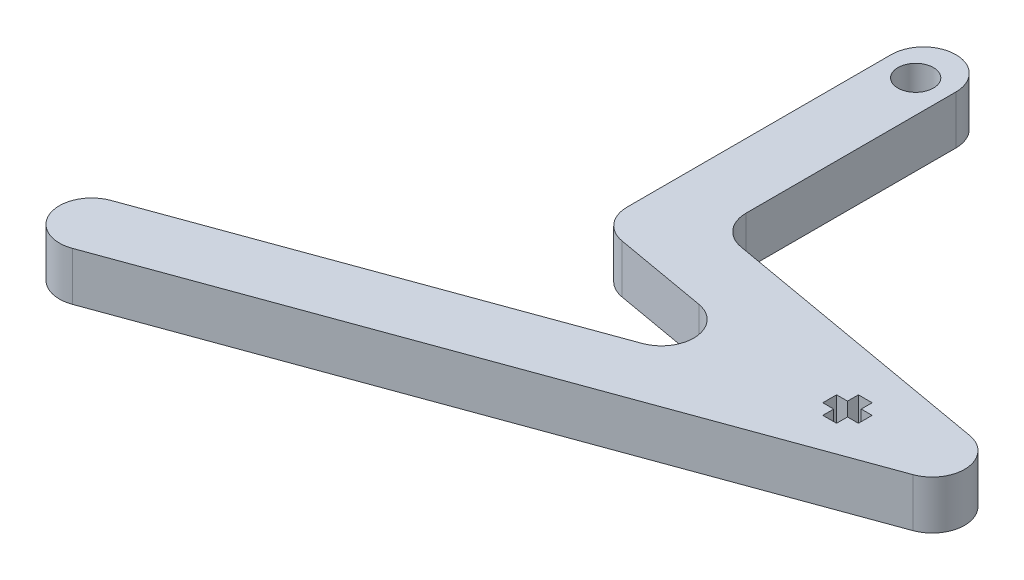
ISO-10303-21;
HEADER;
FILE_DESCRIPTION(('STEP AP214'),'2;1');
FILE_NAME('part.step','',(''),(''),'','','');
FILE_SCHEMA(('AUTOMOTIVE_DESIGN { 1 0 10303 214 1 1 1 1 }'));
ENDSEC;
DATA;
#1=APPLICATION_CONTEXT('core data for automotive mechanical design processes');
#2=APPLICATION_PROTOCOL_DEFINITION('international standard','automotive_design',2000,#1);
#3=PRODUCT_CONTEXT('',#1,'mechanical');
#4=PRODUCT('Part','Part','',(#3));
#5=PRODUCT_RELATED_PRODUCT_CATEGORY('part','',(#4));
#6=PRODUCT_DEFINITION_FORMATION('','',#4);
#7=PRODUCT_DEFINITION_CONTEXT('part definition',#1,'design');
#8=PRODUCT_DEFINITION('design','',#6,#7);
#9=PRODUCT_DEFINITION_SHAPE('','',#8);
#10=(LENGTH_UNIT() NAMED_UNIT(*) SI_UNIT(.MILLI.,.METRE.));
#11=(NAMED_UNIT(*) PLANE_ANGLE_UNIT() SI_UNIT($,.RADIAN.));
#12=(NAMED_UNIT(*) SI_UNIT($,.STERADIAN.) SOLID_ANGLE_UNIT());
#13=UNCERTAINTY_MEASURE_WITH_UNIT(LENGTH_MEASURE(1.E-05),#10,'distance_accuracy_value','');
#14=(GEOMETRIC_REPRESENTATION_CONTEXT(3) GLOBAL_UNCERTAINTY_ASSIGNED_CONTEXT((#13)) GLOBAL_UNIT_ASSIGNED_CONTEXT((#10,
#11,#12)) REPRESENTATION_CONTEXT('',''));
#15=CARTESIAN_POINT('',(0.,0.,0.));
#16=DIRECTION('',(0.,0.,1.));
#17=DIRECTION('',(1.,0.,0.));
#18=AXIS2_PLACEMENT_3D('',#15,#16,#17);
#19=CARTESIAN_POINT('',(0.,6.,0.));
#20=DIRECTION('',(0.,1.,0.));
#21=DIRECTION('',(0.,0.,1.));
#22=AXIS2_PLACEMENT_3D('',#19,#20,#21);
#23=PLANE('',#22);
#24=DIRECTION('',(0.,0.,1.));
#25=VECTOR('',#24,1.);
#26=CARTESIAN_POINT('',(-38.433012349143,6.,-5.2517052601802));
#27=LINE('',#26,#25);
#28=CARTESIAN_POINT('',(-38.433012349143,6.,-5.2517052601802));
#29=VERTEX_POINT('',#28);
#30=CARTESIAN_POINT('',(-38.433012349143,6.,-3.5517052601802));
#31=VERTEX_POINT('',#30);
#32=EDGE_CURVE('E228',#29,#31,#27,.T.);
#33=ORIENTED_EDGE('',*,*,#32,.F.);
#34=DIRECTION('',(-1.,0.,0.));
#35=VECTOR('',#34,1.);
#36=CARTESIAN_POINT('',(-37.083012349143,6.,-5.2517052601802));
#37=LINE('',#36,#35);
#38=CARTESIAN_POINT('',(-37.083012349143,6.,-5.2517052601802));
#39=VERTEX_POINT('',#38);
#40=EDGE_CURVE('E218',#39,#29,#37,.T.);
#41=ORIENTED_EDGE('',*,*,#40,.F.);
#42=DIRECTION('',(0.,0.,1.));
#43=VECTOR('',#42,1.);
#44=CARTESIAN_POINT('',(-37.083012349143,6.,-6.60170526018021));
#45=LINE('',#44,#43);
#46=CARTESIAN_POINT('',(-37.083012349143,6.,-6.60170526018021));
#47=VERTEX_POINT('',#46);
#48=EDGE_CURVE('E263',#47,#39,#45,.T.);
#49=ORIENTED_EDGE('',*,*,#48,.F.);
#50=DIRECTION('',(-1.,0.,0.));
#51=VECTOR('',#50,1.);
#52=CARTESIAN_POINT('',(-35.383012349143,6.,-6.60170526018021));
#53=LINE('',#52,#51);
#54=CARTESIAN_POINT('',(-35.383012349143,6.,-6.60170526018021));
#55=VERTEX_POINT('',#54);
#56=EDGE_CURVE('E260',#55,#47,#53,.T.);
#57=ORIENTED_EDGE('',*,*,#56,.F.);
#58=DIRECTION('',(0.,0.,-1.));
#59=VECTOR('',#58,1.);
#60=CARTESIAN_POINT('',(-35.383012349143,6.,-5.2517052601802));
#61=LINE('',#60,#59);
#62=CARTESIAN_POINT('',(-35.383012349143,6.,-5.2517052601802));
#63=VERTEX_POINT('',#62);
#64=EDGE_CURVE('E258',#63,#55,#61,.T.);
#65=ORIENTED_EDGE('',*,*,#64,.F.);
#66=DIRECTION('',(-1.,0.,0.));
#67=VECTOR('',#66,1.);
#68=CARTESIAN_POINT('',(-34.033012349143,6.,-5.2517052601802));
#69=LINE('',#68,#67);
#70=CARTESIAN_POINT('',(-34.033012349143,6.,-5.2517052601802));
#71=VERTEX_POINT('',#70);
#72=EDGE_CURVE('E256',#71,#63,#69,.T.);
#73=ORIENTED_EDGE('',*,*,#72,.F.);
#74=DIRECTION('',(0.,0.,-1.));
#75=VECTOR('',#74,1.);
#76=CARTESIAN_POINT('',(-34.033012349143,6.,-3.5517052601802));
#77=LINE('',#76,#75);
#78=CARTESIAN_POINT('',(-34.033012349143,6.,-3.5517052601802));
#79=VERTEX_POINT('',#78);
#80=EDGE_CURVE('E254',#79,#71,#77,.T.);
#81=ORIENTED_EDGE('',*,*,#80,.F.);
#82=DIRECTION('',(1.,0.,0.));
#83=VECTOR('',#82,1.);
#84=CARTESIAN_POINT('',(-35.383012349143,6.,-3.5517052601802));
#85=LINE('',#84,#83);
#86=CARTESIAN_POINT('',(-35.383012349143,6.,-3.5517052601802));
#87=VERTEX_POINT('',#86);
#88=EDGE_CURVE('E252',#87,#79,#85,.T.);
#89=ORIENTED_EDGE('',*,*,#88,.F.);
#90=DIRECTION('',(0.,0.,-1.));
#91=VECTOR('',#90,1.);
#92=CARTESIAN_POINT('',(-35.383012349143,6.,-2.2017052601802));
#93=LINE('',#92,#91);
#94=CARTESIAN_POINT('',(-35.383012349143,6.,-2.2017052601802));
#95=VERTEX_POINT('',#94);
#96=EDGE_CURVE('E250',#95,#87,#93,.T.);
#97=ORIENTED_EDGE('',*,*,#96,.F.);
#98=DIRECTION('',(1.,0.,0.));
#99=VECTOR('',#98,1.);
#100=CARTESIAN_POINT('',(-37.083012349143,6.,-2.2017052601802));
#101=LINE('',#100,#99);
#102=CARTESIAN_POINT('',(-37.083012349143,6.,-2.2017052601802));
#103=VERTEX_POINT('',#102);
#104=EDGE_CURVE('E248',#103,#95,#101,.T.);
#105=ORIENTED_EDGE('',*,*,#104,.F.);
#106=DIRECTION('',(0.,0.,1.));
#107=VECTOR('',#106,1.);
#108=CARTESIAN_POINT('',(-37.083012349143,6.,-3.5517052601802));
#109=LINE('',#108,#107);
#110=CARTESIAN_POINT('',(-37.083012349143,6.,-3.5517052601802));
#111=VERTEX_POINT('',#110);
#112=EDGE_CURVE('E243',#111,#103,#109,.T.);
#113=ORIENTED_EDGE('',*,*,#112,.F.);
#114=DIRECTION('',(1.,0.,0.));
#115=VECTOR('',#114,1.);
#116=CARTESIAN_POINT('',(-38.433012349143,6.,-3.5517052601802));
#117=LINE('',#116,#115);
#118=EDGE_CURVE('E241',#31,#111,#117,.T.);
#119=ORIENTED_EDGE('',*,*,#118,.F.);
#120=EDGE_LOOP('',(#33,#41,#49,#57,#65,#73,#81,#89,#97,#105,#113,#119));
#121=FACE_BOUND('',#120,.T.);
#122=DIRECTION('',(0.,0.,1.));
#123=VECTOR('',#122,1.);
#124=CARTESIAN_POINT('',(-71.4790407486558,6.,-49.0484446942367));
#125=LINE('',#124,#123);
#126=CARTESIAN_POINT('',(-71.4790407486558,6.,-45.0484446942367));
#127=VERTEX_POINT('',#126);
#128=CARTESIAN_POINT('',(-71.4790407486558,6.,-12.4048432189458));
#129=VERTEX_POINT('',#128);
#130=EDGE_CURVE('E318',#127,#129,#125,.T.);
#131=ORIENTED_EDGE('',*,*,#130,.T.);
#132=CARTESIAN_POINT('',(-67.4790407486558,6.,-12.4048432189458));
#133=DIRECTION('',(0.,1.,0.));
#134=DIRECTION('',(0.,0.,1.));
#135=AXIS2_PLACEMENT_3D('',#132,#133,#134);
#136=CIRCLE('',#135,4.);
#137=CARTESIAN_POINT('',(-68.1736334593235,6.,-8.46561220689699));
#138=VERTEX_POINT('',#137);
#139=EDGE_CURVE('E392',#129,#138,#136,.T.);
#140=ORIENTED_EDGE('',*,*,#139,.T.);
#141=DIRECTION('',(0.984807753012207,0.,0.173648177666934));
#142=VECTOR('',#141,1.);
#143=CARTESIAN_POINT('',(-71.4790407486558,6.,-9.04844469423671));
#144=LINE('',#143,#142);
#145=CARTESIAN_POINT('',(-56.636218438007,6.,-6.43125465100771));
#146=VERTEX_POINT('',#145);
#147=EDGE_CURVE('E321',#138,#146,#144,.T.);
#148=ORIENTED_EDGE('',*,*,#147,.T.);
#149=CARTESIAN_POINT('',(-57.3308111486747,6.,-2.49202363895887));
#150=DIRECTION('',(0.,1.,0.));
#151=DIRECTION('',(0.,0.,1.));
#152=AXIS2_PLACEMENT_3D('',#149,#150,#151);
#153=CIRCLE('',#152,4.);
#154=CARTESIAN_POINT('',(-55.962730575372,6.,1.26674684418477));
#155=VERTEX_POINT('',#154);
#156=EDGE_CURVE('E11',#146,#155,#153,.F.);
#157=ORIENTED_EDGE('',*,*,#156,.T.);
#158=DIRECTION('',(-0.939692620785912,0.,0.34202014332566));
#159=VECTOR('',#158,1.);
#160=CARTESIAN_POINT('',(-41.9348081582896,6.,-3.83899936422869));
#161=LINE('',#160,#159);
#162=CARTESIAN_POINT('',(-104.089454919572,6.,18.7834419782077));
#163=VERTEX_POINT('',#162);
#164=EDGE_CURVE('E325',#155,#163,#161,.T.);
#165=ORIENTED_EDGE('',*,*,#164,.T.);
#166=CARTESIAN_POINT('',(-102.72137434627,6.,22.5422124613514));
#167=DIRECTION('',(0.,1.,0.));
#168=DIRECTION('',(0.,0.,1.));
#169=AXIS2_PLACEMENT_3D('',#166,#167,#168);
#170=CIRCLE('',#169,4.);
#171=CARTESIAN_POINT('',(-106.480144829413,6.,23.910293034654));
#172=VERTEX_POINT('',#171);
#173=EDGE_CURVE('E389',#163,#172,#170,.T.);
#174=ORIENTED_EDGE('',*,*,#173,.T.);
#175=CARTESIAN_POINT('',(-102.72137434627,6.,22.5422124613514));
#176=DIRECTION('',(0.,1.,0.));
#177=DIRECTION('',(0.,0.,1.));
#178=AXIS2_PLACEMENT_3D('',#175,#176,#177);
#179=CIRCLE('',#178,4.);
#180=CARTESIAN_POINT('',(-101.353293772967,6.,26.300982944495));
#181=VERTEX_POINT('',#180);
#182=EDGE_CURVE('E66',#172,#181,#179,.T.);
#183=ORIENTED_EDGE('',*,*,#182,.T.);
#184=DIRECTION('',(0.939692620785912,0.,-0.34202014332566));
#185=VECTOR('',#184,1.);
#186=CARTESIAN_POINT('',(-105.112064256111,6.,27.6690635177977));
#187=LINE('',#186,#185);
#188=CARTESIAN_POINT('',(-25.1707245946019,6.,-1.42720460635487));
#189=VERTEX_POINT('',#188);
#190=EDGE_CURVE('E328',#181,#189,#187,.T.);
#191=ORIENTED_EDGE('',*,*,#190,.T.);
#192=CARTESIAN_POINT('',(-26.5388051679045,6.,-5.18597508949852));
#193=DIRECTION('',(0.,1.,0.));
#194=DIRECTION('',(0.,0.,1.));
#195=AXIS2_PLACEMENT_3D('',#192,#193,#194);
#196=CIRCLE('',#195,4.);
#197=CARTESIAN_POINT('',(-25.8442124572368,6.,-9.12520610154735));
#198=VERTEX_POINT('',#197);
#199=EDGE_CURVE('E387',#189,#198,#196,.T.);
#200=ORIENTED_EDGE('',*,*,#199,.T.);
#201=DIRECTION('',(-0.984807753012207,0.,-0.173648177666934));
#202=VECTOR('',#201,1.);
#203=CARTESIAN_POINT('',(-63.4790407486558,6.,-15.7612417436549));
#204=LINE('',#203,#202);
#205=CARTESIAN_POINT('',(-60.1736334593235,6.,-15.1784092563152));
#206=VERTEX_POINT('',#205);
#207=EDGE_CURVE('E330',#198,#206,#204,.T.);
#208=ORIENTED_EDGE('',*,*,#207,.T.);
#209=CARTESIAN_POINT('',(-59.4790407486558,6.,-19.117640268364));
#210=DIRECTION('',(0.,1.,0.));
#211=DIRECTION('',(0.,0.,1.));
#212=AXIS2_PLACEMENT_3D('',#209,#210,#211);
#213=CIRCLE('',#212,4.);
#214=CARTESIAN_POINT('',(-63.4790407486558,6.,-19.117640268364));
#215=VERTEX_POINT('',#214);
#216=EDGE_CURVE('E405',#206,#215,#213,.F.);
#217=ORIENTED_EDGE('',*,*,#216,.T.);
#218=DIRECTION('',(0.,0.,-1.));
#219=VECTOR('',#218,1.);
#220=CARTESIAN_POINT('',(-63.4790407486558,6.,-15.7612417436549));
#221=LINE('',#220,#219);
#222=CARTESIAN_POINT('',(-63.4790407486558,6.,-45.0484446942367));
#223=VERTEX_POINT('',#222);
#224=EDGE_CURVE('E333',#215,#223,#221,.T.);
#225=ORIENTED_EDGE('',*,*,#224,.T.);
#226=CARTESIAN_POINT('',(-67.4790407486558,6.,-45.0484446942367));
#227=DIRECTION('',(0.,1.,0.));
#228=DIRECTION('',(0.,0.,1.));
#229=AXIS2_PLACEMENT_3D('',#226,#227,#228);
#230=CIRCLE('',#229,4.);
#231=CARTESIAN_POINT('',(-67.4790407486558,6.,-49.0484446942367));
#232=VERTEX_POINT('',#231);
#233=EDGE_CURVE('E385',#223,#232,#230,.T.);
#234=ORIENTED_EDGE('',*,*,#233,.T.);
#235=CARTESIAN_POINT('',(-67.4790407486558,6.,-45.0484446942367));
#236=DIRECTION('',(0.,1.,0.));
#237=DIRECTION('',(0.,0.,1.));
#238=AXIS2_PLACEMENT_3D('',#235,#236,#237);
#239=CIRCLE('',#238,4.);
#240=EDGE_CURVE('E383',#232,#127,#239,.T.);
#241=ORIENTED_EDGE('',*,*,#240,.T.);
#242=EDGE_LOOP('',(#131,#140,#148,#157,#165,#174,#183,#191,#200,#208,#217,#225,#234,#241));
#243=FACE_BOUND('',#242,.T.);
#244=CARTESIAN_POINT('',(-67.4790407486558,6.,-44.0774757166165));
#245=DIRECTION('',(0.,1.,0.));
#246=DIRECTION('',(0.,0.,1.));
#247=AXIS2_PLACEMENT_3D('',#244,#245,#246);
#248=CIRCLE('',#247,2.2);
#249=CARTESIAN_POINT('',(-67.4790407486558,6.,-41.8774757166165));
#250=VERTEX_POINT('',#249);
#251=EDGE_CURVE('E267',#250,#250,#248,.T.);
#252=ORIENTED_EDGE('',*,*,#251,.F.);
#253=EDGE_LOOP('',(#252));
#254=FACE_BOUND('',#253,.T.);
#255=ADVANCED_FACE('F42',(#121,#243,#254),#23,.T.);
#256=CARTESIAN_POINT('',(0.,0.,0.));
#257=DIRECTION('',(0.,1.,0.));
#258=DIRECTION('',(0.,0.,1.));
#259=AXIS2_PLACEMENT_3D('',#256,#257,#258);
#260=PLANE('',#259);
#261=DIRECTION('',(0.984807753012207,0.,0.173648177666934));
#262=VECTOR('',#261,1.);
#263=CARTESIAN_POINT('',(-71.4790407486558,0.,-9.04844469423671));
#264=LINE('',#263,#262);
#265=CARTESIAN_POINT('',(-68.1736334593235,0.,-8.46561220689699));
#266=VERTEX_POINT('',#265);
#267=CARTESIAN_POINT('',(-56.636218438007,0.,-6.43125465100771));
#268=VERTEX_POINT('',#267);
#269=EDGE_CURVE('E339',#266,#268,#264,.T.);
#270=ORIENTED_EDGE('',*,*,#269,.F.);
#271=CARTESIAN_POINT('',(-67.4790407486558,0.,-12.4048432189458));
#272=DIRECTION('',(0.,1.,0.));
#273=DIRECTION('',(0.,0.,1.));
#274=AXIS2_PLACEMENT_3D('',#271,#272,#273);
#275=CIRCLE('',#274,4.);
#276=CARTESIAN_POINT('',(-71.4790407486558,0.,-12.4048432189458));
#277=VERTEX_POINT('',#276);
#278=EDGE_CURVE('E377',#266,#277,#275,.F.);
#279=ORIENTED_EDGE('',*,*,#278,.T.);
#280=DIRECTION('',(0.,0.,1.));
#281=VECTOR('',#280,1.);
#282=CARTESIAN_POINT('',(-71.4790407486558,0.,-49.0484446942367));
#283=LINE('',#282,#281);
#284=CARTESIAN_POINT('',(-71.4790407486558,0.,-45.0484446942367));
#285=VERTEX_POINT('',#284);
#286=EDGE_CURVE('E236',#285,#277,#283,.T.);
#287=ORIENTED_EDGE('',*,*,#286,.F.);
#288=CARTESIAN_POINT('',(-67.4790407486558,0.,-45.0484446942367));
#289=DIRECTION('',(0.,1.,0.));
#290=DIRECTION('',(0.,0.,1.));
#291=AXIS2_PLACEMENT_3D('',#288,#289,#290);
#292=CIRCLE('',#291,4.);
#293=CARTESIAN_POINT('',(-67.4790407486558,0.,-49.0484446942367));
#294=VERTEX_POINT('',#293);
#295=EDGE_CURVE('E367',#285,#294,#292,.F.);
#296=ORIENTED_EDGE('',*,*,#295,.T.);
#297=CARTESIAN_POINT('',(-67.4790407486558,0.,-45.0484446942367));
#298=DIRECTION('',(0.,1.,0.));
#299=DIRECTION('',(0.,0.,1.));
#300=AXIS2_PLACEMENT_3D('',#297,#298,#299);
#301=CIRCLE('',#300,4.);
#302=CARTESIAN_POINT('',(-63.4790407486558,0.,-45.0484446942367));
#303=VERTEX_POINT('',#302);
#304=EDGE_CURVE('E369',#294,#303,#301,.F.);
#305=ORIENTED_EDGE('',*,*,#304,.T.);
#306=DIRECTION('',(0.,0.,-1.));
#307=VECTOR('',#306,1.);
#308=CARTESIAN_POINT('',(-63.4790407486558,0.,-15.7612417436549));
#309=LINE('',#308,#307);
#310=CARTESIAN_POINT('',(-63.4790407486558,0.,-19.117640268364));
#311=VERTEX_POINT('',#310);
#312=EDGE_CURVE('E322',#311,#303,#309,.T.);
#313=ORIENTED_EDGE('',*,*,#312,.F.);
#314=CARTESIAN_POINT('',(-59.4790407486558,0.,-19.117640268364));
#315=DIRECTION('',(0.,1.,0.));
#316=DIRECTION('',(0.,0.,1.));
#317=AXIS2_PLACEMENT_3D('',#314,#315,#316);
#318=CIRCLE('',#317,4.);
#319=CARTESIAN_POINT('',(-60.1736334593235,0.,-15.1784092563152));
#320=VERTEX_POINT('',#319);
#321=EDGE_CURVE('E403',#311,#320,#318,.T.);
#322=ORIENTED_EDGE('',*,*,#321,.T.);
#323=DIRECTION('',(-0.984807753012207,0.,-0.173648177666934));
#324=VECTOR('',#323,1.);
#325=CARTESIAN_POINT('',(-63.4790407486558,0.,-15.7612417436549));
#326=LINE('',#325,#324);
#327=CARTESIAN_POINT('',(-25.8442124572368,0.,-9.12520610154735));
#328=VERTEX_POINT('',#327);
#329=EDGE_CURVE('E347',#328,#320,#326,.T.);
#330=ORIENTED_EDGE('',*,*,#329,.F.);
#331=CARTESIAN_POINT('',(-26.5388051679045,0.,-5.18597508949852));
#332=DIRECTION('',(0.,1.,0.));
#333=DIRECTION('',(0.,0.,1.));
#334=AXIS2_PLACEMENT_3D('',#331,#332,#333);
#335=CIRCLE('',#334,4.);
#336=CARTESIAN_POINT('',(-25.1707245946019,0.,-1.42720460635487));
#337=VERTEX_POINT('',#336);
#338=EDGE_CURVE('E371',#328,#337,#335,.F.);
#339=ORIENTED_EDGE('',*,*,#338,.T.);
#340=DIRECTION('',(0.939692620785912,0.,-0.34202014332566));
#341=VECTOR('',#340,1.);
#342=CARTESIAN_POINT('',(-105.112064256111,0.,27.6690635177977));
#343=LINE('',#342,#341);
#344=CARTESIAN_POINT('',(-101.353293772967,0.,26.300982944495));
#345=VERTEX_POINT('',#344);
#346=EDGE_CURVE('E345',#345,#337,#343,.T.);
#347=ORIENTED_EDGE('',*,*,#346,.F.);
#348=CARTESIAN_POINT('',(-102.72137434627,0.,22.5422124613514));
#349=DIRECTION('',(0.,1.,0.));
#350=DIRECTION('',(0.,0.,1.));
#351=AXIS2_PLACEMENT_3D('',#348,#349,#350);
#352=CIRCLE('',#351,4.);
#353=CARTESIAN_POINT('',(-106.480144829413,0.,23.910293034654));
#354=VERTEX_POINT('',#353);
#355=EDGE_CURVE('E375',#345,#354,#352,.F.);
#356=ORIENTED_EDGE('',*,*,#355,.T.);
#357=CARTESIAN_POINT('',(-102.72137434627,0.,22.5422124613514));
#358=DIRECTION('',(0.,1.,0.));
#359=DIRECTION('',(0.,0.,1.));
#360=AXIS2_PLACEMENT_3D('',#357,#358,#359);
#361=CIRCLE('',#360,4.);
#362=CARTESIAN_POINT('',(-104.089454919572,0.,18.7834419782077));
#363=VERTEX_POINT('',#362);
#364=EDGE_CURVE('E373',#354,#363,#361,.F.);
#365=ORIENTED_EDGE('',*,*,#364,.T.);
#366=DIRECTION('',(-0.939692620785912,0.,0.34202014332566));
#367=VECTOR('',#366,1.);
#368=CARTESIAN_POINT('',(-41.9348081582896,0.,-3.83899936422869));
#369=LINE('',#368,#367);
#370=CARTESIAN_POINT('',(-55.962730575372,0.,1.26674684418477));
#371=VERTEX_POINT('',#370);
#372=EDGE_CURVE('E342',#371,#363,#369,.T.);
#373=ORIENTED_EDGE('',*,*,#372,.F.);
#374=CARTESIAN_POINT('',(-57.3308111486747,0.,-2.49202363895887));
#375=DIRECTION('',(0.,1.,0.));
#376=DIRECTION('',(0.,0.,1.));
#377=AXIS2_PLACEMENT_3D('',#374,#375,#376);
#378=CIRCLE('',#377,4.);
#379=EDGE_CURVE('E51',#371,#268,#378,.T.);
#380=ORIENTED_EDGE('',*,*,#379,.T.);
#381=EDGE_LOOP('',(#270,#279,#287,#296,#305,#313,#322,#330,#339,#347,#356,#365,#373,#380));
#382=FACE_BOUND('',#381,.T.);
#383=DIRECTION('',(-1.,0.,0.));
#384=VECTOR('',#383,1.);
#385=CARTESIAN_POINT('',(-37.083012349143,0.,-5.2517052601802));
#386=LINE('',#385,#384);
#387=CARTESIAN_POINT('',(-37.083012349143,0.,-5.2517052601802));
#388=VERTEX_POINT('',#387);
#389=CARTESIAN_POINT('',(-38.433012349143,0.,-5.2517052601802));
#390=VERTEX_POINT('',#389);
#391=EDGE_CURVE('E265',#388,#390,#386,.T.);
#392=ORIENTED_EDGE('',*,*,#391,.T.);
#393=DIRECTION('',(0.,0.,1.));
#394=VECTOR('',#393,1.);
#395=CARTESIAN_POINT('',(-38.433012349143,0.,-5.2517052601802));
#396=LINE('',#395,#394);
#397=CARTESIAN_POINT('',(-38.433012349143,0.,-3.5517052601802));
#398=VERTEX_POINT('',#397);
#399=EDGE_CURVE('E235',#390,#398,#396,.T.);
#400=ORIENTED_EDGE('',*,*,#399,.T.);
#401=DIRECTION('',(1.,0.,0.));
#402=VECTOR('',#401,1.);
#403=CARTESIAN_POINT('',(-38.433012349143,0.,-3.5517052601802));
#404=LINE('',#403,#402);
#405=CARTESIAN_POINT('',(-37.083012349143,0.,-3.5517052601802));
#406=VERTEX_POINT('',#405);
#407=EDGE_CURVE('E269',#398,#406,#404,.T.);
#408=ORIENTED_EDGE('',*,*,#407,.T.);
#409=DIRECTION('',(0.,0.,1.));
#410=VECTOR('',#409,1.);
#411=CARTESIAN_POINT('',(-37.083012349143,0.,-3.5517052601802));
#412=LINE('',#411,#410);
#413=CARTESIAN_POINT('',(-37.083012349143,0.,-2.2017052601802));
#414=VERTEX_POINT('',#413);
#415=EDGE_CURVE('E272',#406,#414,#412,.T.);
#416=ORIENTED_EDGE('',*,*,#415,.T.);
#417=DIRECTION('',(1.,0.,0.));
#418=VECTOR('',#417,1.);
#419=CARTESIAN_POINT('',(-37.083012349143,0.,-2.2017052601802));
#420=LINE('',#419,#418);
#421=CARTESIAN_POINT('',(-35.383012349143,0.,-2.2017052601802));
#422=VERTEX_POINT('',#421);
#423=EDGE_CURVE('E275',#414,#422,#420,.T.);
#424=ORIENTED_EDGE('',*,*,#423,.T.);
#425=DIRECTION('',(0.,0.,-1.));
#426=VECTOR('',#425,1.);
#427=CARTESIAN_POINT('',(-35.383012349143,0.,-2.2017052601802));
#428=LINE('',#427,#426);
#429=CARTESIAN_POINT('',(-35.383012349143,0.,-3.5517052601802));
#430=VERTEX_POINT('',#429);
#431=EDGE_CURVE('E278',#422,#430,#428,.T.);
#432=ORIENTED_EDGE('',*,*,#431,.T.);
#433=DIRECTION('',(1.,0.,0.));
#434=VECTOR('',#433,1.);
#435=CARTESIAN_POINT('',(-35.383012349143,0.,-3.5517052601802));
#436=LINE('',#435,#434);
#437=CARTESIAN_POINT('',(-34.033012349143,0.,-3.5517052601802));
#438=VERTEX_POINT('',#437);
#439=EDGE_CURVE('E281',#430,#438,#436,.T.);
#440=ORIENTED_EDGE('',*,*,#439,.T.);
#441=DIRECTION('',(0.,0.,-1.));
#442=VECTOR('',#441,1.);
#443=CARTESIAN_POINT('',(-34.033012349143,0.,-3.5517052601802));
#444=LINE('',#443,#442);
#445=CARTESIAN_POINT('',(-34.033012349143,0.,-5.2517052601802));
#446=VERTEX_POINT('',#445);
#447=EDGE_CURVE('E284',#438,#446,#444,.T.);
#448=ORIENTED_EDGE('',*,*,#447,.T.);
#449=DIRECTION('',(-1.,0.,0.));
#450=VECTOR('',#449,1.);
#451=CARTESIAN_POINT('',(-34.033012349143,0.,-5.2517052601802));
#452=LINE('',#451,#450);
#453=CARTESIAN_POINT('',(-35.383012349143,0.,-5.2517052601802));
#454=VERTEX_POINT('',#453);
#455=EDGE_CURVE('E287',#446,#454,#452,.T.);
#456=ORIENTED_EDGE('',*,*,#455,.T.);
#457=DIRECTION('',(0.,0.,-1.));
#458=VECTOR('',#457,1.);
#459=CARTESIAN_POINT('',(-35.383012349143,0.,-5.2517052601802));
#460=LINE('',#459,#458);
#461=CARTESIAN_POINT('',(-35.383012349143,0.,-6.60170526018021));
#462=VERTEX_POINT('',#461);
#463=EDGE_CURVE('E290',#454,#462,#460,.T.);
#464=ORIENTED_EDGE('',*,*,#463,.T.);
#465=DIRECTION('',(-1.,0.,0.));
#466=VECTOR('',#465,1.);
#467=CARTESIAN_POINT('',(-35.383012349143,0.,-6.60170526018021));
#468=LINE('',#467,#466);
#469=CARTESIAN_POINT('',(-37.083012349143,0.,-6.60170526018021));
#470=VERTEX_POINT('',#469);
#471=EDGE_CURVE('E293',#462,#470,#468,.T.);
#472=ORIENTED_EDGE('',*,*,#471,.T.);
#473=DIRECTION('',(0.,0.,1.));
#474=VECTOR('',#473,1.);
#475=CARTESIAN_POINT('',(-37.083012349143,0.,-6.60170526018021));
#476=LINE('',#475,#474);
#477=EDGE_CURVE('E229',#470,#388,#476,.T.);
#478=ORIENTED_EDGE('',*,*,#477,.T.);
#479=EDGE_LOOP('',(#392,#400,#408,#416,#424,#432,#440,#448,#456,#464,#472,#478));
#480=FACE_BOUND('',#479,.T.);
#481=CARTESIAN_POINT('',(-67.4790407486558,0.,-44.0774757166165));
#482=DIRECTION('',(0.,1.,0.));
#483=DIRECTION('',(0.,0.,1.));
#484=AXIS2_PLACEMENT_3D('',#481,#482,#483);
#485=CIRCLE('',#484,2.2);
#486=CARTESIAN_POINT('',(-67.4790407486558,0.,-41.8774757166165));
#487=VERTEX_POINT('',#486);
#488=EDGE_CURVE('E409',#487,#487,#485,.T.);
#489=ORIENTED_EDGE('',*,*,#488,.T.);
#490=EDGE_LOOP('',(#489));
#491=FACE_BOUND('',#490,.T.);
#492=ADVANCED_FACE('F456',(#382,#480,#491),#260,.F.);
#493=CARTESIAN_POINT('',(-71.4790407486558,6.,-49.0484446942367));
#494=DIRECTION('',(1.,0.,0.));
#495=DIRECTION('',(0.,0.,-1.));
#496=AXIS2_PLACEMENT_3D('',#493,#494,#495);
#497=PLANE('',#496);
#498=ORIENTED_EDGE('',*,*,#286,.T.);
#499=DIRECTION('',(0.,-1.,0.));
#500=VECTOR('',#499,1.);
#501=CARTESIAN_POINT('',(-71.4790407486558,6.,-12.4048432189458));
#502=LINE('',#501,#500);
#503=EDGE_CURVE('E381',#277,#129,#502,.F.);
#504=ORIENTED_EDGE('',*,*,#503,.T.);
#505=ORIENTED_EDGE('',*,*,#130,.F.);
#506=DIRECTION('',(0.,-1.,0.));
#507=VECTOR('',#506,1.);
#508=CARTESIAN_POINT('',(-71.4790407486558,6.,-45.0484446942367));
#509=LINE('',#508,#507);
#510=EDGE_CURVE('E379',#127,#285,#509,.T.);
#511=ORIENTED_EDGE('',*,*,#510,.T.);
#512=EDGE_LOOP('',(#498,#504,#505,#511));
#513=FACE_BOUND('',#512,.T.);
#514=ADVANCED_FACE('F427',(#513),#497,.F.);
#515=CARTESIAN_POINT('',(-71.4790407486558,6.,-9.04844469423671));
#516=DIRECTION('',(0.173648177666934,0.,-0.984807753012207));
#517=DIRECTION('',(-0.984807753012208,0.,-0.173648177666934));
#518=AXIS2_PLACEMENT_3D('',#515,#516,#517);
#519=PLANE('',#518);
#520=ORIENTED_EDGE('',*,*,#147,.F.);
#521=DIRECTION('',(0.,-1.,0.));
#522=VECTOR('',#521,1.);
#523=CARTESIAN_POINT('',(-68.1736334593235,6.,-8.46561220689699));
#524=LINE('',#523,#522);
#525=EDGE_CURVE('E364',#138,#266,#524,.T.);
#526=ORIENTED_EDGE('',*,*,#525,.T.);
#527=ORIENTED_EDGE('',*,*,#269,.T.);
#528=DIRECTION('',(0.,-1.,0.));
#529=VECTOR('',#528,1.);
#530=CARTESIAN_POINT('',(-56.636218438007,6.,-6.4312546510077));
#531=LINE('',#530,#529);
#532=EDGE_CURVE('E362',#268,#146,#531,.F.);
#533=ORIENTED_EDGE('',*,*,#532,.T.);
#534=EDGE_LOOP('',(#520,#526,#527,#533));
#535=FACE_BOUND('',#534,.T.);
#536=ADVANCED_FACE('F436',(#535),#519,.F.);
#537=CARTESIAN_POINT('',(-41.9348081582896,6.,-3.83899936422869));
#538=DIRECTION('',(0.34202014332566,0.,0.939692620785912));
#539=DIRECTION('',(0.939692620785912,0.,-0.34202014332566));
#540=AXIS2_PLACEMENT_3D('',#537,#538,#539);
#541=PLANE('',#540);
#542=ORIENTED_EDGE('',*,*,#372,.T.);
#543=DIRECTION('',(0.,-1.,0.));
#544=VECTOR('',#543,1.);
#545=CARTESIAN_POINT('',(-104.089454919572,6.,18.7834419782077));
#546=LINE('',#545,#544);
#547=EDGE_CURVE('E401',#363,#163,#546,.F.);
#548=ORIENTED_EDGE('',*,*,#547,.T.);
#549=ORIENTED_EDGE('',*,*,#164,.F.);
#550=DIRECTION('',(0.,-1.,0.));
#551=VECTOR('',#550,1.);
#552=CARTESIAN_POINT('',(-55.962730575372,0.,1.26674684418478));
#553=LINE('',#552,#551);
#554=EDGE_CURVE('E398',#155,#371,#553,.T.);
#555=ORIENTED_EDGE('',*,*,#554,.T.);
#556=EDGE_LOOP('',(#542,#548,#549,#555));
#557=FACE_BOUND('',#556,.T.);
#558=ADVANCED_FACE('F445',(#557),#541,.F.);
#559=CARTESIAN_POINT('',(-105.112064256111,6.,27.6690635177977));
#560=DIRECTION('',(-0.34202014332566,0.,-0.939692620785912));
#561=DIRECTION('',(-0.939692620785912,0.,0.34202014332566));
#562=AXIS2_PLACEMENT_3D('',#559,#560,#561);
#563=PLANE('',#562);
#564=ORIENTED_EDGE('',*,*,#190,.F.);
#565=DIRECTION('',(0.,-1.,0.));
#566=VECTOR('',#565,1.);
#567=CARTESIAN_POINT('',(-101.353293772967,6.,26.300982944495));
#568=LINE('',#567,#566);
#569=EDGE_CURVE('E395',#181,#345,#568,.T.);
#570=ORIENTED_EDGE('',*,*,#569,.T.);
#571=ORIENTED_EDGE('',*,*,#346,.T.);
#572=DIRECTION('',(0.,-1.,0.));
#573=VECTOR('',#572,1.);
#574=CARTESIAN_POINT('',(-25.1707245946019,6.,-1.42720460635487));
#575=LINE('',#574,#573);
#576=EDGE_CURVE('E59',#337,#189,#575,.F.);
#577=ORIENTED_EDGE('',*,*,#576,.T.);
#578=EDGE_LOOP('',(#564,#570,#571,#577));
#579=FACE_BOUND('',#578,.T.);
#580=ADVANCED_FACE('F454',(#579),#563,.F.);
#581=CARTESIAN_POINT('',(-63.4790407486558,6.,-15.7612417436549));
#582=DIRECTION('',(-0.173648177666934,0.,0.984807753012207));
#583=DIRECTION('',(0.984807753012208,0.,0.173648177666934));
#584=AXIS2_PLACEMENT_3D('',#581,#582,#583);
#585=PLANE('',#584);
#586=ORIENTED_EDGE('',*,*,#329,.T.);
#587=DIRECTION('',(0.,-1.,0.));
#588=VECTOR('',#587,1.);
#589=CARTESIAN_POINT('',(-60.1736334593235,6.,-15.1784092563152));
#590=LINE('',#589,#588);
#591=EDGE_CURVE('E360',#320,#206,#590,.F.);
#592=ORIENTED_EDGE('',*,*,#591,.T.);
#593=ORIENTED_EDGE('',*,*,#207,.F.);
#594=DIRECTION('',(0.,-1.,0.));
#595=VECTOR('',#594,1.);
#596=CARTESIAN_POINT('',(-25.8442124572367,6.,-9.12520610154735));
#597=LINE('',#596,#595);
#598=EDGE_CURVE('E357',#198,#328,#597,.T.);
#599=ORIENTED_EDGE('',*,*,#598,.T.);
#600=EDGE_LOOP('',(#586,#592,#593,#599));
#601=FACE_BOUND('',#600,.T.);
#602=ADVANCED_FACE('F465',(#601),#585,.F.);
#603=CARTESIAN_POINT('',(-63.4790407486558,6.,-15.7612417436549));
#604=DIRECTION('',(-1.,0.,0.));
#605=DIRECTION('',(0.,0.,1.));
#606=AXIS2_PLACEMENT_3D('',#603,#604,#605);
#607=PLANE('',#606);
#608=ORIENTED_EDGE('',*,*,#224,.F.);
#609=DIRECTION('',(0.,-1.,0.));
#610=VECTOR('',#609,1.);
#611=CARTESIAN_POINT('',(-63.4790407486558,0.,-19.117640268364));
#612=LINE('',#611,#610);
#613=EDGE_CURVE('E354',#215,#311,#612,.T.);
#614=ORIENTED_EDGE('',*,*,#613,.T.);
#615=ORIENTED_EDGE('',*,*,#312,.T.);
#616=DIRECTION('',(0.,-1.,0.));
#617=VECTOR('',#616,1.);
#618=CARTESIAN_POINT('',(-63.4790407486558,6.,-45.0484446942367));
#619=LINE('',#618,#617);
#620=EDGE_CURVE('E336',#303,#223,#619,.F.);
#621=ORIENTED_EDGE('',*,*,#620,.T.);
#622=EDGE_LOOP('',(#608,#614,#615,#621));
#623=FACE_BOUND('',#622,.T.);
#624=ADVANCED_FACE('F474',(#623),#607,.F.);
#625=CARTESIAN_POINT('',(-37.083012349143,6.,-5.2517052601802));
#626=DIRECTION('',(0.,0.,1.));
#627=DIRECTION('',(1.,0.,0.));
#628=AXIS2_PLACEMENT_3D('',#625,#626,#627);
#629=PLANE('',#628);
#630=ORIENTED_EDGE('',*,*,#391,.F.);
#631=DIRECTION('',(0.,-1.,0.));
#632=VECTOR('',#631,1.);
#633=CARTESIAN_POINT('',(-37.083012349143,6.,-5.2517052601802));
#634=LINE('',#633,#632);
#635=EDGE_CURVE('E224',#39,#388,#634,.T.);
#636=ORIENTED_EDGE('',*,*,#635,.F.);
#637=ORIENTED_EDGE('',*,*,#40,.T.);
#638=DIRECTION('',(0.,-1.,0.));
#639=VECTOR('',#638,1.);
#640=CARTESIAN_POINT('',(-38.433012349143,6.,-5.2517052601802));
#641=LINE('',#640,#639);
#642=EDGE_CURVE('E221',#29,#390,#641,.T.);
#643=ORIENTED_EDGE('',*,*,#642,.T.);
#644=EDGE_LOOP('',(#630,#636,#637,#643));
#645=FACE_BOUND('',#644,.T.);
#646=ADVANCED_FACE('F220',(#645),#629,.T.);
#647=CARTESIAN_POINT('',(-38.433012349143,6.,-5.2517052601802));
#648=DIRECTION('',(1.,0.,0.));
#649=DIRECTION('',(0.,0.,-1.));
#650=AXIS2_PLACEMENT_3D('',#647,#648,#649);
#651=PLANE('',#650);
#652=ORIENTED_EDGE('',*,*,#399,.F.);
#653=ORIENTED_EDGE('',*,*,#642,.F.);
#654=ORIENTED_EDGE('',*,*,#32,.T.);
#655=DIRECTION('',(0.,-1.,0.));
#656=VECTOR('',#655,1.);
#657=CARTESIAN_POINT('',(-38.433012349143,6.,-3.5517052601802));
#658=LINE('',#657,#656);
#659=EDGE_CURVE('E237',#31,#398,#658,.T.);
#660=ORIENTED_EDGE('',*,*,#659,.T.);
#661=EDGE_LOOP('',(#652,#653,#654,#660));
#662=FACE_BOUND('',#661,.T.);
#663=ADVANCED_FACE('F232',(#662),#651,.T.);
#664=CARTESIAN_POINT('',(-38.433012349143,6.,-3.5517052601802));
#665=DIRECTION('',(0.,0.,-1.));
#666=DIRECTION('',(-1.,0.,0.));
#667=AXIS2_PLACEMENT_3D('',#664,#665,#666);
#668=PLANE('',#667);
#669=ORIENTED_EDGE('',*,*,#407,.F.);
#670=ORIENTED_EDGE('',*,*,#659,.F.);
#671=ORIENTED_EDGE('',*,*,#118,.T.);
#672=DIRECTION('',(0.,-1.,0.));
#673=VECTOR('',#672,1.);
#674=CARTESIAN_POINT('',(-37.083012349143,6.,-3.5517052601802));
#675=LINE('',#674,#673);
#676=EDGE_CURVE('E315',#111,#406,#675,.T.);
#677=ORIENTED_EDGE('',*,*,#676,.T.);
#678=EDGE_LOOP('',(#669,#670,#671,#677));
#679=FACE_BOUND('',#678,.T.);
#680=ADVANCED_FACE('F494',(#679),#668,.T.);
#681=CARTESIAN_POINT('',(-37.083012349143,6.,-3.5517052601802));
#682=DIRECTION('',(1.,0.,0.));
#683=DIRECTION('',(0.,0.,-1.));
#684=AXIS2_PLACEMENT_3D('',#681,#682,#683);
#685=PLANE('',#684);
#686=ORIENTED_EDGE('',*,*,#415,.F.);
#687=ORIENTED_EDGE('',*,*,#676,.F.);
#688=ORIENTED_EDGE('',*,*,#112,.T.);
#689=DIRECTION('',(0.,-1.,0.));
#690=VECTOR('',#689,1.);
#691=CARTESIAN_POINT('',(-37.083012349143,6.,-2.2017052601802));
#692=LINE('',#691,#690);
#693=EDGE_CURVE('E313',#103,#414,#692,.T.);
#694=ORIENTED_EDGE('',*,*,#693,.T.);
#695=EDGE_LOOP('',(#686,#687,#688,#694));
#696=FACE_BOUND('',#695,.T.);
#697=ADVANCED_FACE('F497',(#696),#685,.T.);
#698=CARTESIAN_POINT('',(-37.083012349143,6.,-2.2017052601802));
#699=DIRECTION('',(0.,0.,-1.));
#700=DIRECTION('',(-1.,0.,0.));
#701=AXIS2_PLACEMENT_3D('',#698,#699,#700);
#702=PLANE('',#701);
#703=ORIENTED_EDGE('',*,*,#423,.F.);
#704=ORIENTED_EDGE('',*,*,#693,.F.);
#705=ORIENTED_EDGE('',*,*,#104,.T.);
#706=DIRECTION('',(0.,-1.,0.));
#707=VECTOR('',#706,1.);
#708=CARTESIAN_POINT('',(-35.383012349143,6.,-2.2017052601802));
#709=LINE('',#708,#707);
#710=EDGE_CURVE('E311',#95,#422,#709,.T.);
#711=ORIENTED_EDGE('',*,*,#710,.T.);
#712=EDGE_LOOP('',(#703,#704,#705,#711));
#713=FACE_BOUND('',#712,.T.);
#714=ADVANCED_FACE('F501',(#713),#702,.T.);
#715=CARTESIAN_POINT('',(-35.383012349143,6.,-2.2017052601802));
#716=DIRECTION('',(-1.,0.,0.));
#717=DIRECTION('',(0.,0.,1.));
#718=AXIS2_PLACEMENT_3D('',#715,#716,#717);
#719=PLANE('',#718);
#720=ORIENTED_EDGE('',*,*,#431,.F.);
#721=ORIENTED_EDGE('',*,*,#710,.F.);
#722=ORIENTED_EDGE('',*,*,#96,.T.);
#723=DIRECTION('',(0.,-1.,0.));
#724=VECTOR('',#723,1.);
#725=CARTESIAN_POINT('',(-35.383012349143,6.,-3.5517052601802));
#726=LINE('',#725,#724);
#727=EDGE_CURVE('E309',#87,#430,#726,.T.);
#728=ORIENTED_EDGE('',*,*,#727,.T.);
#729=EDGE_LOOP('',(#720,#721,#722,#728));
#730=FACE_BOUND('',#729,.T.);
#731=ADVANCED_FACE('F505',(#730),#719,.T.);
#732=CARTESIAN_POINT('',(-35.383012349143,6.,-3.5517052601802));
#733=DIRECTION('',(0.,0.,-1.));
#734=DIRECTION('',(-1.,0.,0.));
#735=AXIS2_PLACEMENT_3D('',#732,#733,#734);
#736=PLANE('',#735);
#737=ORIENTED_EDGE('',*,*,#439,.F.);
#738=ORIENTED_EDGE('',*,*,#727,.F.);
#739=ORIENTED_EDGE('',*,*,#88,.T.);
#740=DIRECTION('',(0.,-1.,0.));
#741=VECTOR('',#740,1.);
#742=CARTESIAN_POINT('',(-34.033012349143,6.,-3.5517052601802));
#743=LINE('',#742,#741);
#744=EDGE_CURVE('E307',#79,#438,#743,.T.);
#745=ORIENTED_EDGE('',*,*,#744,.T.);
#746=EDGE_LOOP('',(#737,#738,#739,#745));
#747=FACE_BOUND('',#746,.T.);
#748=ADVANCED_FACE('F509',(#747),#736,.T.);
#749=CARTESIAN_POINT('',(-34.033012349143,6.,-3.5517052601802));
#750=DIRECTION('',(-1.,0.,0.));
#751=DIRECTION('',(0.,0.,1.));
#752=AXIS2_PLACEMENT_3D('',#749,#750,#751);
#753=PLANE('',#752);
#754=ORIENTED_EDGE('',*,*,#447,.F.);
#755=ORIENTED_EDGE('',*,*,#744,.F.);
#756=ORIENTED_EDGE('',*,*,#80,.T.);
#757=DIRECTION('',(0.,-1.,0.));
#758=VECTOR('',#757,1.);
#759=CARTESIAN_POINT('',(-34.033012349143,6.,-5.2517052601802));
#760=LINE('',#759,#758);
#761=EDGE_CURVE('E305',#71,#446,#760,.T.);
#762=ORIENTED_EDGE('',*,*,#761,.T.);
#763=EDGE_LOOP('',(#754,#755,#756,#762));
#764=FACE_BOUND('',#763,.T.);
#765=ADVANCED_FACE('F513',(#764),#753,.T.);
#766=CARTESIAN_POINT('',(-34.033012349143,6.,-5.2517052601802));
#767=DIRECTION('',(0.,0.,1.));
#768=DIRECTION('',(1.,0.,0.));
#769=AXIS2_PLACEMENT_3D('',#766,#767,#768);
#770=PLANE('',#769);
#771=ORIENTED_EDGE('',*,*,#455,.F.);
#772=ORIENTED_EDGE('',*,*,#761,.F.);
#773=ORIENTED_EDGE('',*,*,#72,.T.);
#774=DIRECTION('',(0.,-1.,0.));
#775=VECTOR('',#774,1.);
#776=CARTESIAN_POINT('',(-35.383012349143,6.,-5.2517052601802));
#777=LINE('',#776,#775);
#778=EDGE_CURVE('E303',#63,#454,#777,.T.);
#779=ORIENTED_EDGE('',*,*,#778,.T.);
#780=EDGE_LOOP('',(#771,#772,#773,#779));
#781=FACE_BOUND('',#780,.T.);
#782=ADVANCED_FACE('F517',(#781),#770,.T.);
#783=CARTESIAN_POINT('',(-35.383012349143,6.,-5.2517052601802));
#784=DIRECTION('',(-1.,0.,0.));
#785=DIRECTION('',(0.,0.,1.));
#786=AXIS2_PLACEMENT_3D('',#783,#784,#785);
#787=PLANE('',#786);
#788=ORIENTED_EDGE('',*,*,#463,.F.);
#789=ORIENTED_EDGE('',*,*,#778,.F.);
#790=ORIENTED_EDGE('',*,*,#64,.T.);
#791=DIRECTION('',(0.,-1.,0.));
#792=VECTOR('',#791,1.);
#793=CARTESIAN_POINT('',(-35.383012349143,6.,-6.60170526018021));
#794=LINE('',#793,#792);
#795=EDGE_CURVE('E301',#55,#462,#794,.T.);
#796=ORIENTED_EDGE('',*,*,#795,.T.);
#797=EDGE_LOOP('',(#788,#789,#790,#796));
#798=FACE_BOUND('',#797,.T.);
#799=ADVANCED_FACE('F521',(#798),#787,.T.);
#800=CARTESIAN_POINT('',(-35.383012349143,6.,-6.60170526018021));
#801=DIRECTION('',(0.,0.,1.));
#802=DIRECTION('',(1.,0.,0.));
#803=AXIS2_PLACEMENT_3D('',#800,#801,#802);
#804=PLANE('',#803);
#805=ORIENTED_EDGE('',*,*,#471,.F.);
#806=ORIENTED_EDGE('',*,*,#795,.F.);
#807=ORIENTED_EDGE('',*,*,#56,.T.);
#808=DIRECTION('',(0.,-1.,0.));
#809=VECTOR('',#808,1.);
#810=CARTESIAN_POINT('',(-37.083012349143,6.,-6.60170526018021));
#811=LINE('',#810,#809);
#812=EDGE_CURVE('E299',#47,#470,#811,.T.);
#813=ORIENTED_EDGE('',*,*,#812,.T.);
#814=EDGE_LOOP('',(#805,#806,#807,#813));
#815=FACE_BOUND('',#814,.T.);
#816=ADVANCED_FACE('F525',(#815),#804,.T.);
#817=CARTESIAN_POINT('',(-37.083012349143,6.,-6.60170526018021));
#818=DIRECTION('',(1.,0.,0.));
#819=DIRECTION('',(0.,0.,-1.));
#820=AXIS2_PLACEMENT_3D('',#817,#818,#819);
#821=PLANE('',#820);
#822=ORIENTED_EDGE('',*,*,#477,.F.);
#823=ORIENTED_EDGE('',*,*,#812,.F.);
#824=ORIENTED_EDGE('',*,*,#48,.T.);
#825=ORIENTED_EDGE('',*,*,#635,.T.);
#826=EDGE_LOOP('',(#822,#823,#824,#825));
#827=FACE_BOUND('',#826,.T.);
#828=ADVANCED_FACE('F529',(#827),#821,.T.);
#829=CARTESIAN_POINT('',(-67.4790407486558,6.,-44.0774757166165));
#830=DIRECTION('',(0.,-1.,0.));
#831=DIRECTION('',(0.,0.,-1.));
#832=AXIS2_PLACEMENT_3D('',#829,#830,#831);
#833=CYLINDRICAL_SURFACE('',#832,2.2);
#834=ORIENTED_EDGE('',*,*,#251,.T.);
#835=EDGE_LOOP('',(#834));
#836=FACE_BOUND('',#835,.T.);
#837=ORIENTED_EDGE('',*,*,#488,.F.);
#838=EDGE_LOOP('',(#837));
#839=FACE_BOUND('',#838,.T.);
#840=ADVANCED_FACE('F533',(#836,#839),#833,.F.);
#841=CARTESIAN_POINT('',(-59.4790407486558,6.,-19.117640268364));
#842=DIRECTION('',(0.,1.,0.));
#843=DIRECTION('',(0.,0.,1.));
#844=AXIS2_PLACEMENT_3D('',#841,#842,#843);
#845=CYLINDRICAL_SURFACE('',#844,4.);
#846=ORIENTED_EDGE('',*,*,#216,.F.);
#847=ORIENTED_EDGE('',*,*,#591,.F.);
#848=ORIENTED_EDGE('',*,*,#321,.F.);
#849=ORIENTED_EDGE('',*,*,#613,.F.);
#850=EDGE_LOOP('',(#846,#847,#848,#849));
#851=FACE_BOUND('',#850,.T.);
#852=ADVANCED_FACE('F471',(#851),#845,.F.);
#853=CARTESIAN_POINT('',(-67.4790407486558,6.,-12.4048432189458));
#854=DIRECTION('',(0.,-1.,0.));
#855=DIRECTION('',(0.,0.,-1.));
#856=AXIS2_PLACEMENT_3D('',#853,#854,#855);
#857=CYLINDRICAL_SURFACE('',#856,4.);
#858=ORIENTED_EDGE('',*,*,#139,.F.);
#859=ORIENTED_EDGE('',*,*,#503,.F.);
#860=ORIENTED_EDGE('',*,*,#278,.F.);
#861=ORIENTED_EDGE('',*,*,#525,.F.);
#862=EDGE_LOOP('',(#858,#859,#860,#861));
#863=FACE_BOUND('',#862,.T.);
#864=ADVANCED_FACE('F431',(#863),#857,.T.);
#865=CARTESIAN_POINT('',(-102.72137434627,6.,22.5422124613514));
#866=DIRECTION('',(0.,-1.,0.));
#867=DIRECTION('',(0.,0.,-1.));
#868=AXIS2_PLACEMENT_3D('',#865,#866,#867);
#869=CYLINDRICAL_SURFACE('',#868,4.);
#870=DIRECTION('',(0.,-1.,0.));
#871=VECTOR('',#870,1.);
#872=CARTESIAN_POINT('',(-106.480144829413,6.,23.910293034654));
#873=LINE('',#872,#871);
#874=EDGE_CURVE('E407',#172,#354,#873,.T.);
#875=ORIENTED_EDGE('',*,*,#874,.F.);
#876=ORIENTED_EDGE('',*,*,#173,.F.);
#877=ORIENTED_EDGE('',*,*,#547,.F.);
#878=ORIENTED_EDGE('',*,*,#364,.F.);
#879=EDGE_LOOP('',(#875,#876,#877,#878));
#880=FACE_BOUND('',#879,.T.);
#881=ADVANCED_FACE('F450',(#880),#869,.T.);
#882=CARTESIAN_POINT('',(-102.72137434627,6.,22.5422124613514));
#883=DIRECTION('',(0.,-1.,0.));
#884=DIRECTION('',(0.,0.,-1.));
#885=AXIS2_PLACEMENT_3D('',#882,#883,#884);
#886=CYLINDRICAL_SURFACE('',#885,4.);
#887=ORIENTED_EDGE('',*,*,#182,.F.);
#888=ORIENTED_EDGE('',*,*,#874,.T.);
#889=ORIENTED_EDGE('',*,*,#355,.F.);
#890=ORIENTED_EDGE('',*,*,#569,.F.);
#891=EDGE_LOOP('',(#887,#888,#889,#890));
#892=FACE_BOUND('',#891,.T.);
#893=ADVANCED_FACE('F452',(#892),#886,.T.);
#894=CARTESIAN_POINT('',(-57.3308111486747,6.,-2.49202363895887));
#895=DIRECTION('',(0.,1.,0.));
#896=DIRECTION('',(0.,0.,1.));
#897=AXIS2_PLACEMENT_3D('',#894,#895,#896);
#898=CYLINDRICAL_SURFACE('',#897,4.);
#899=ORIENTED_EDGE('',*,*,#156,.F.);
#900=ORIENTED_EDGE('',*,*,#532,.F.);
#901=ORIENTED_EDGE('',*,*,#379,.F.);
#902=ORIENTED_EDGE('',*,*,#554,.F.);
#903=EDGE_LOOP('',(#899,#900,#901,#902));
#904=FACE_BOUND('',#903,.T.);
#905=ADVANCED_FACE('F440',(#904),#898,.F.);
#906=CARTESIAN_POINT('',(-26.5388051679045,6.,-5.18597508949852));
#907=DIRECTION('',(0.,-1.,0.));
#908=DIRECTION('',(0.,0.,-1.));
#909=AXIS2_PLACEMENT_3D('',#906,#907,#908);
#910=CYLINDRICAL_SURFACE('',#909,4.);
#911=ORIENTED_EDGE('',*,*,#199,.F.);
#912=ORIENTED_EDGE('',*,*,#576,.F.);
#913=ORIENTED_EDGE('',*,*,#338,.F.);
#914=ORIENTED_EDGE('',*,*,#598,.F.);
#915=EDGE_LOOP('',(#911,#912,#913,#914));
#916=FACE_BOUND('',#915,.T.);
#917=ADVANCED_FACE('F462',(#916),#910,.T.);
#918=CARTESIAN_POINT('',(-67.4790407486558,6.,-45.0484446942367));
#919=DIRECTION('',(0.,-1.,0.));
#920=DIRECTION('',(0.,0.,-1.));
#921=AXIS2_PLACEMENT_3D('',#918,#919,#920);
#922=CYLINDRICAL_SURFACE('',#921,4.);
#923=ORIENTED_EDGE('',*,*,#510,.F.);
#924=ORIENTED_EDGE('',*,*,#240,.F.);
#925=DIRECTION('',(0.,-1.,0.));
#926=VECTOR('',#925,1.);
#927=CARTESIAN_POINT('',(-67.4790407486558,6.,-49.0484446942367));
#928=LINE('',#927,#926);
#929=EDGE_CURVE('E46',#294,#232,#928,.F.);
#930=ORIENTED_EDGE('',*,*,#929,.F.);
#931=ORIENTED_EDGE('',*,*,#295,.F.);
#932=EDGE_LOOP('',(#923,#924,#930,#931));
#933=FACE_BOUND('',#932,.T.);
#934=ADVANCED_FACE('F44',(#933),#922,.T.);
#935=CARTESIAN_POINT('',(-67.4790407486558,6.,-45.0484446942367));
#936=DIRECTION('',(0.,-1.,0.));
#937=DIRECTION('',(0.,0.,-1.));
#938=AXIS2_PLACEMENT_3D('',#935,#936,#937);
#939=CYLINDRICAL_SURFACE('',#938,4.);
#940=ORIENTED_EDGE('',*,*,#233,.F.);
#941=ORIENTED_EDGE('',*,*,#620,.F.);
#942=ORIENTED_EDGE('',*,*,#304,.F.);
#943=ORIENTED_EDGE('',*,*,#929,.T.);
#944=EDGE_LOOP('',(#940,#941,#942,#943));
#945=FACE_BOUND('',#944,.T.);
#946=ADVANCED_FACE('F417',(#945),#939,.T.);
#947=CLOSED_SHELL('',(#255,#492,#514,#536,#558,#580,#602,#624,#646,#663,#680,#697,#714,#731,
#748,#765,#782,#799,#816,#828,#840,#852,#864,#881,#893,#905,#917,#934,#946));
#948=MANIFOLD_SOLID_BREP('B2',#947);
#949=ADVANCED_BREP_SHAPE_REPRESENTATION('',(#18,#948),#14);
#950=SHAPE_DEFINITION_REPRESENTATION(#9,#949);
ENDSEC;
END-ISO-10303-21;
